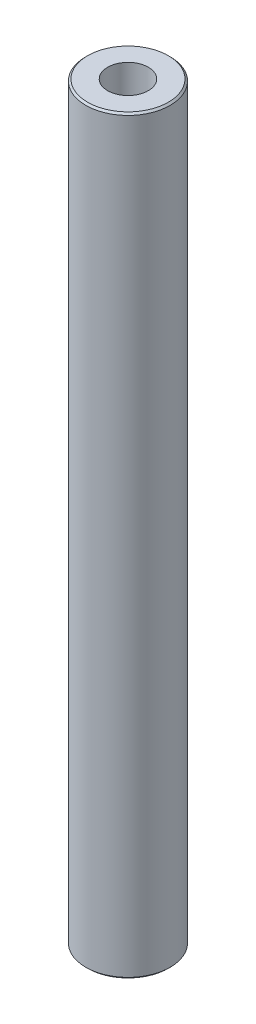
ISO-10303-21;
HEADER;
FILE_DESCRIPTION(('STEP AP214'),'2;1');
FILE_NAME('part.step','',(''),(''),'','','');
FILE_SCHEMA(('AUTOMOTIVE_DESIGN { 1 0 10303 214 1 1 1 1 }'));
ENDSEC;
DATA;
#1=APPLICATION_CONTEXT('core data for automotive mechanical design processes');
#2=APPLICATION_PROTOCOL_DEFINITION('international standard','automotive_design',2000,#1);
#3=PRODUCT_CONTEXT('',#1,'mechanical');
#4=PRODUCT('Part','Part','',(#3));
#5=PRODUCT_RELATED_PRODUCT_CATEGORY('part','',(#4));
#6=PRODUCT_DEFINITION_FORMATION('','',#4);
#7=PRODUCT_DEFINITION_CONTEXT('part definition',#1,'design');
#8=PRODUCT_DEFINITION('design','',#6,#7);
#9=PRODUCT_DEFINITION_SHAPE('','',#8);
#10=(LENGTH_UNIT() NAMED_UNIT(*) SI_UNIT(.MILLI.,.METRE.));
#11=(NAMED_UNIT(*) PLANE_ANGLE_UNIT() SI_UNIT($,.RADIAN.));
#12=(NAMED_UNIT(*) SI_UNIT($,.STERADIAN.) SOLID_ANGLE_UNIT());
#13=UNCERTAINTY_MEASURE_WITH_UNIT(LENGTH_MEASURE(1.E-05),#10,'distance_accuracy_value','');
#14=(GEOMETRIC_REPRESENTATION_CONTEXT(3) GLOBAL_UNCERTAINTY_ASSIGNED_CONTEXT((#13)) GLOBAL_UNIT_ASSIGNED_CONTEXT((#10,
#11,#12)) REPRESENTATION_CONTEXT('',''));
#15=CARTESIAN_POINT('',(0.,0.,0.));
#16=DIRECTION('',(0.,0.,1.));
#17=DIRECTION('',(1.,0.,0.));
#18=AXIS2_PLACEMENT_3D('',#15,#16,#17);
#19=CARTESIAN_POINT('',(0.,533.684171174887,0.));
#20=DIRECTION('',(0.,-1.,0.));
#21=DIRECTION('',(0.,0.,-1.));
#22=AXIS2_PLACEMENT_3D('',#19,#20,#21);
#23=CYLINDRICAL_SURFACE('',#22,30.);
#24=CARTESIAN_POINT('',(0.,532.39868701156,0.));
#25=DIRECTION('',(0.,1.,0.));
#26=DIRECTION('',(0.,0.,1.));
#27=AXIS2_PLACEMENT_3D('',#24,#25,#26);
#28=CIRCLE('',#27,30.);
#29=CARTESIAN_POINT('',(0.,532.39868701156,30.));
#30=VERTEX_POINT('',#29);
#31=EDGE_CURVE('E50',#30,#30,#28,.F.);
#32=ORIENTED_EDGE('',*,*,#31,.T.);
#33=EDGE_LOOP('',(#32));
#34=FACE_BOUND('',#33,.T.);
#35=CARTESIAN_POINT('',(0.,1.28548416332652,0.));
#36=DIRECTION('',(0.,1.,0.));
#37=DIRECTION('',(0.,0.,1.));
#38=AXIS2_PLACEMENT_3D('',#35,#36,#37);
#39=CIRCLE('',#38,30.);
#40=CARTESIAN_POINT('',(0.,1.28548416332652,30.));
#41=VERTEX_POINT('',#40);
#42=EDGE_CURVE('E51',#41,#41,#39,.T.);
#43=ORIENTED_EDGE('',*,*,#42,.T.);
#44=EDGE_LOOP('',(#43));
#45=FACE_BOUND('',#44,.T.);
#46=ADVANCED_FACE('F39',(#34,#45),#23,.T.);
#47=CARTESIAN_POINT('',(0.,533.684171174887,0.));
#48=DIRECTION('',(0.,1.,0.));
#49=DIRECTION('',(0.,0.,1.));
#50=AXIS2_PLACEMENT_3D('',#47,#48,#49);
#51=PLANE('',#50);
#52=CARTESIAN_POINT('',(0.,533.684171174887,0.));
#53=DIRECTION('',(0.,1.,0.));
#54=DIRECTION('',(0.,0.,1.));
#55=AXIS2_PLACEMENT_3D('',#52,#53,#54);
#56=CIRCLE('',#55,28.7145158366736);
#57=CARTESIAN_POINT('',(0.,533.684171174887,28.7145158366736));
#58=VERTEX_POINT('',#57);
#59=EDGE_CURVE('E54',#58,#58,#56,.T.);
#60=ORIENTED_EDGE('',*,*,#59,.T.);
#61=EDGE_LOOP('',(#60));
#62=FACE_BOUND('',#61,.T.);
#63=CARTESIAN_POINT('',(0.,533.684171174887,0.));
#64=DIRECTION('',(0.,1.,0.));
#65=DIRECTION('',(0.,0.,1.));
#66=AXIS2_PLACEMENT_3D('',#63,#64,#65);
#67=CIRCLE('',#66,14.474919073989);
#68=CARTESIAN_POINT('',(0.,533.684171174887,14.474919073989));
#69=VERTEX_POINT('',#68);
#70=EDGE_CURVE('E58',#69,#69,#67,.T.);
#71=ORIENTED_EDGE('',*,*,#70,.F.);
#72=EDGE_LOOP('',(#71));
#73=FACE_BOUND('',#72,.T.);
#74=ADVANCED_FACE('F69',(#62,#73),#51,.T.);
#75=CARTESIAN_POINT('',(0.,0.,0.));
#76=DIRECTION('',(0.,1.,0.));
#77=DIRECTION('',(0.,0.,1.));
#78=AXIS2_PLACEMENT_3D('',#75,#76,#77);
#79=PLANE('',#78);
#80=CARTESIAN_POINT('',(0.,0.,0.));
#81=DIRECTION('',(0.,1.,0.));
#82=DIRECTION('',(0.,0.,1.));
#83=AXIS2_PLACEMENT_3D('',#80,#81,#82);
#84=CIRCLE('',#83,28.7145158366734);
#85=CARTESIAN_POINT('',(0.,0.,28.7145158366734));
#86=VERTEX_POINT('',#85);
#87=EDGE_CURVE('E10',#86,#86,#84,.F.);
#88=ORIENTED_EDGE('',*,*,#87,.T.);
#89=EDGE_LOOP('',(#88));
#90=FACE_BOUND('',#89,.T.);
#91=CARTESIAN_POINT('',(0.,0.,0.));
#92=DIRECTION('',(0.,1.,0.));
#93=DIRECTION('',(0.,0.,1.));
#94=AXIS2_PLACEMENT_3D('',#91,#92,#93);
#95=CIRCLE('',#94,14.474919073989);
#96=CARTESIAN_POINT('',(0.,0.,14.474919073989));
#97=VERTEX_POINT('',#96);
#98=EDGE_CURVE('E63',#97,#97,#95,.T.);
#99=ORIENTED_EDGE('',*,*,#98,.T.);
#100=EDGE_LOOP('',(#99));
#101=FACE_BOUND('',#100,.T.);
#102=ADVANCED_FACE('F75',(#90,#101),#79,.F.);
#103=CARTESIAN_POINT('',(0.,533.684171174887,0.));
#104=DIRECTION('',(0.,-1.,0.));
#105=DIRECTION('',(0.,0.,-1.));
#106=AXIS2_PLACEMENT_3D('',#103,#104,#105);
#107=CYLINDRICAL_SURFACE('',#106,14.474919073989);
#108=ORIENTED_EDGE('',*,*,#70,.T.);
#109=EDGE_LOOP('',(#108));
#110=FACE_BOUND('',#109,.T.);
#111=ORIENTED_EDGE('',*,*,#98,.F.);
#112=EDGE_LOOP('',(#111));
#113=FACE_BOUND('',#112,.T.);
#114=ADVANCED_FACE('F70',(#110,#113),#107,.F.);
#115=CARTESIAN_POINT('',(0.,533.684171174887,0.));
#116=DIRECTION('',(0.,-1.,0.));
#117=DIRECTION('',(0.,0.,-1.));
#118=AXIS2_PLACEMENT_3D('',#115,#116,#117);
#119=CONICAL_SURFACE('',#118,28.7145158366736,0.785398163397459);
#120=ORIENTED_EDGE('',*,*,#31,.F.);
#121=EDGE_LOOP('',(#120));
#122=FACE_BOUND('',#121,.T.);
#123=ORIENTED_EDGE('',*,*,#59,.F.);
#124=EDGE_LOOP('',(#123));
#125=FACE_BOUND('',#124,.T.);
#126=ADVANCED_FACE('F81',(#122,#125),#119,.T.);
#127=CARTESIAN_POINT('',(0.,1.28548416332652,0.));
#128=DIRECTION('',(0.,1.,0.));
#129=DIRECTION('',(0.,0.,1.));
#130=AXIS2_PLACEMENT_3D('',#127,#128,#129);
#131=CONICAL_SURFACE('',#130,30.,0.785398163397459);
#132=ORIENTED_EDGE('',*,*,#87,.F.);
#133=EDGE_LOOP('',(#132));
#134=FACE_BOUND('',#133,.T.);
#135=ORIENTED_EDGE('',*,*,#42,.F.);
#136=EDGE_LOOP('',(#135));
#137=FACE_BOUND('',#136,.T.);
#138=ADVANCED_FACE('F45',(#134,#137),#131,.T.);
#139=CLOSED_SHELL('',(#46,#74,#102,#114,#126,#138));
#140=MANIFOLD_SOLID_BREP('B2',#139);
#141=ADVANCED_BREP_SHAPE_REPRESENTATION('',(#18,#140),#14);
#142=SHAPE_DEFINITION_REPRESENTATION(#9,#141);
ENDSEC;
END-ISO-10303-21;
